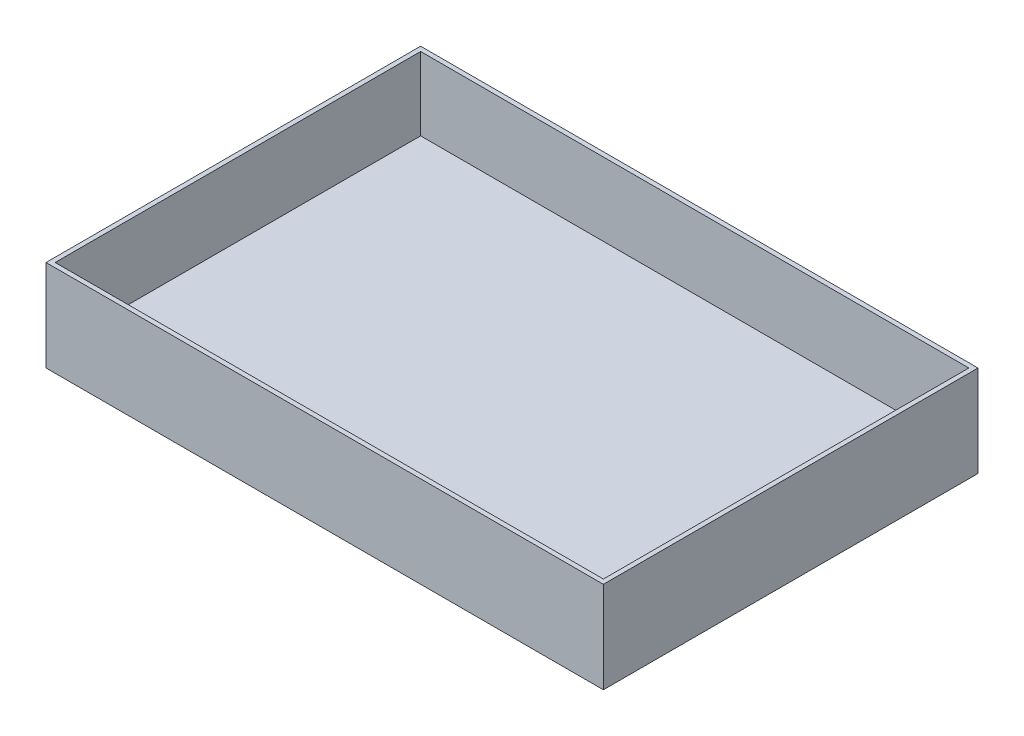
ISO-10303-21;
HEADER;
FILE_DESCRIPTION(('STEP AP214'),'2;1');
FILE_NAME('part.step','',(''),(''),'','','');
FILE_SCHEMA(('AUTOMOTIVE_DESIGN { 1 0 10303 214 1 1 1 1 }'));
ENDSEC;
DATA;
#1=APPLICATION_CONTEXT('core data for automotive mechanical design processes');
#2=APPLICATION_PROTOCOL_DEFINITION('international standard','automotive_design',2000,#1);
#3=PRODUCT_CONTEXT('',#1,'mechanical');
#4=PRODUCT('Part','Part','',(#3));
#5=PRODUCT_RELATED_PRODUCT_CATEGORY('part','',(#4));
#6=PRODUCT_DEFINITION_FORMATION('','',#4);
#7=PRODUCT_DEFINITION_CONTEXT('part definition',#1,'design');
#8=PRODUCT_DEFINITION('design','',#6,#7);
#9=PRODUCT_DEFINITION_SHAPE('','',#8);
#10=(LENGTH_UNIT() NAMED_UNIT(*) SI_UNIT(.MILLI.,.METRE.));
#11=(NAMED_UNIT(*) PLANE_ANGLE_UNIT() SI_UNIT($,.RADIAN.));
#12=(NAMED_UNIT(*) SI_UNIT($,.STERADIAN.) SOLID_ANGLE_UNIT());
#13=UNCERTAINTY_MEASURE_WITH_UNIT(LENGTH_MEASURE(1.E-05),#10,'distance_accuracy_value','');
#14=(GEOMETRIC_REPRESENTATION_CONTEXT(3) GLOBAL_UNCERTAINTY_ASSIGNED_CONTEXT((#13)) GLOBAL_UNIT_ASSIGNED_CONTEXT((#10,
#11,#12)) REPRESENTATION_CONTEXT('',''));
#15=CARTESIAN_POINT('',(0.,0.,0.));
#16=DIRECTION('',(0.,0.,1.));
#17=DIRECTION('',(1.,0.,0.));
#18=AXIS2_PLACEMENT_3D('',#15,#16,#17);
#19=CARTESIAN_POINT('',(-30.5,10.,-20.5));
#20=DIRECTION('',(1.,0.,0.));
#21=DIRECTION('',(0.,0.,-1.));
#22=AXIS2_PLACEMENT_3D('',#19,#20,#21);
#23=PLANE('',#22);
#24=DIRECTION('',(0.,0.,1.));
#25=VECTOR('',#24,1.);
#26=CARTESIAN_POINT('',(-30.5,0.,-20.5));
#27=LINE('',#26,#25);
#28=CARTESIAN_POINT('',(-30.5,0.,-20.5));
#29=VERTEX_POINT('',#28);
#30=CARTESIAN_POINT('',(-30.5,0.,20.5));
#31=VERTEX_POINT('',#30);
#32=EDGE_CURVE('E157',#29,#31,#27,.T.);
#33=ORIENTED_EDGE('',*,*,#32,.T.);
#34=DIRECTION('',(0.,-1.,0.));
#35=VECTOR('',#34,1.);
#36=CARTESIAN_POINT('',(-30.5,10.,20.5));
#37=LINE('',#36,#35);
#38=CARTESIAN_POINT('',(-30.5,10.,20.5));
#39=VERTEX_POINT('',#38);
#40=EDGE_CURVE('E11',#39,#31,#37,.T.);
#41=ORIENTED_EDGE('',*,*,#40,.F.);
#42=DIRECTION('',(0.,0.,1.));
#43=VECTOR('',#42,1.);
#44=CARTESIAN_POINT('',(-30.5,10.,-20.5));
#45=LINE('',#44,#43);
#46=CARTESIAN_POINT('',(-30.5,10.,-20.5));
#47=VERTEX_POINT('',#46);
#48=EDGE_CURVE('E163',#47,#39,#45,.T.);
#49=ORIENTED_EDGE('',*,*,#48,.F.);
#50=DIRECTION('',(0.,-1.,0.));
#51=VECTOR('',#50,1.);
#52=CARTESIAN_POINT('',(-30.5,10.,-20.5));
#53=LINE('',#52,#51);
#54=EDGE_CURVE('E63',#47,#29,#53,.T.);
#55=ORIENTED_EDGE('',*,*,#54,.T.);
#56=EDGE_LOOP('',(#33,#41,#49,#55));
#57=FACE_BOUND('',#56,.T.);
#58=ADVANCED_FACE('F39',(#57),#23,.F.);
#59=CARTESIAN_POINT('',(-30.5,10.,20.5));
#60=DIRECTION('',(0.,0.,-1.));
#61=DIRECTION('',(-1.,0.,0.));
#62=AXIS2_PLACEMENT_3D('',#59,#60,#61);
#63=PLANE('',#62);
#64=DIRECTION('',(1.,0.,0.));
#65=VECTOR('',#64,1.);
#66=CARTESIAN_POINT('',(-30.5,0.,20.5));
#67=LINE('',#66,#65);
#68=CARTESIAN_POINT('',(30.5,0.,20.5));
#69=VERTEX_POINT('',#68);
#70=EDGE_CURVE('E178',#31,#69,#67,.T.);
#71=ORIENTED_EDGE('',*,*,#70,.T.);
#72=DIRECTION('',(0.,-1.,0.));
#73=VECTOR('',#72,1.);
#74=CARTESIAN_POINT('',(30.5,10.,20.5));
#75=LINE('',#74,#73);
#76=CARTESIAN_POINT('',(30.5,10.,20.5));
#77=VERTEX_POINT('',#76);
#78=EDGE_CURVE('E47',#77,#69,#75,.T.);
#79=ORIENTED_EDGE('',*,*,#78,.F.);
#80=DIRECTION('',(1.,0.,0.));
#81=VECTOR('',#80,1.);
#82=CARTESIAN_POINT('',(-30.5,10.,20.5));
#83=LINE('',#82,#81);
#84=EDGE_CURVE('E89',#39,#77,#83,.T.);
#85=ORIENTED_EDGE('',*,*,#84,.F.);
#86=ORIENTED_EDGE('',*,*,#40,.T.);
#87=EDGE_LOOP('',(#71,#79,#85,#86));
#88=FACE_BOUND('',#87,.T.);
#89=ADVANCED_FACE('F198',(#88),#63,.F.);
#90=CARTESIAN_POINT('',(30.5,10.,-20.5));
#91=DIRECTION('',(1.,0.,0.));
#92=DIRECTION('',(0.,0.,-1.));
#93=AXIS2_PLACEMENT_3D('',#90,#91,#92);
#94=PLANE('',#93);
#95=DIRECTION('',(0.,0.,1.));
#96=VECTOR('',#95,1.);
#97=CARTESIAN_POINT('',(30.5,0.,-20.5));
#98=LINE('',#97,#96);
#99=CARTESIAN_POINT('',(30.5,0.,-20.5));
#100=VERTEX_POINT('',#99);
#101=EDGE_CURVE('E182',#100,#69,#98,.T.);
#102=ORIENTED_EDGE('',*,*,#101,.F.);
#103=DIRECTION('',(0.,-1.,0.));
#104=VECTOR('',#103,1.);
#105=CARTESIAN_POINT('',(30.5,10.,-20.5));
#106=LINE('',#105,#104);
#107=CARTESIAN_POINT('',(30.5,10.,-20.5));
#108=VERTEX_POINT('',#107);
#109=EDGE_CURVE('E191',#108,#100,#106,.T.);
#110=ORIENTED_EDGE('',*,*,#109,.F.);
#111=DIRECTION('',(0.,0.,1.));
#112=VECTOR('',#111,1.);
#113=CARTESIAN_POINT('',(30.5,10.,-20.5));
#114=LINE('',#113,#112);
#115=EDGE_CURVE('E169',#108,#77,#114,.T.);
#116=ORIENTED_EDGE('',*,*,#115,.T.);
#117=ORIENTED_EDGE('',*,*,#78,.T.);
#118=EDGE_LOOP('',(#102,#110,#116,#117));
#119=FACE_BOUND('',#118,.T.);
#120=ADVANCED_FACE('F196',(#119),#94,.T.);
#121=CARTESIAN_POINT('',(-30.5,10.,-20.5));
#122=DIRECTION('',(0.,0.,-1.));
#123=DIRECTION('',(-1.,0.,0.));
#124=AXIS2_PLACEMENT_3D('',#121,#122,#123);
#125=PLANE('',#124);
#126=DIRECTION('',(1.,0.,0.));
#127=VECTOR('',#126,1.);
#128=CARTESIAN_POINT('',(-30.5,0.,-20.5));
#129=LINE('',#128,#127);
#130=EDGE_CURVE('E166',#29,#100,#129,.T.);
#131=ORIENTED_EDGE('',*,*,#130,.F.);
#132=ORIENTED_EDGE('',*,*,#54,.F.);
#133=DIRECTION('',(1.,0.,0.));
#134=VECTOR('',#133,1.);
#135=CARTESIAN_POINT('',(-30.5,10.,-20.5));
#136=LINE('',#135,#134);
#137=EDGE_CURVE('E173',#47,#108,#136,.T.);
#138=ORIENTED_EDGE('',*,*,#137,.T.);
#139=ORIENTED_EDGE('',*,*,#109,.T.);
#140=EDGE_LOOP('',(#131,#132,#138,#139));
#141=FACE_BOUND('',#140,.T.);
#142=ADVANCED_FACE('F202',(#141),#125,.T.);
#143=CARTESIAN_POINT('',(0.,10.,0.));
#144=DIRECTION('',(0.,1.,0.));
#145=DIRECTION('',(0.,0.,1.));
#146=AXIS2_PLACEMENT_3D('',#143,#144,#145);
#147=PLANE('',#146);
#148=DIRECTION('',(0.,0.,-1.));
#149=VECTOR('',#148,1.);
#150=CARTESIAN_POINT('',(30.,10.,-20.));
#151=LINE('',#150,#149);
#152=CARTESIAN_POINT('',(30.,10.,20.));
#153=VERTEX_POINT('',#152);
#154=CARTESIAN_POINT('',(30.,10.,-20.));
#155=VERTEX_POINT('',#154);
#156=EDGE_CURVE('E54',#153,#155,#151,.T.);
#157=ORIENTED_EDGE('',*,*,#156,.F.);
#158=DIRECTION('',(1.,0.,0.));
#159=VECTOR('',#158,1.);
#160=CARTESIAN_POINT('',(-30.,10.,20.));
#161=LINE('',#160,#159);
#162=CARTESIAN_POINT('',(-30.,10.,20.));
#163=VERTEX_POINT('',#162);
#164=EDGE_CURVE('E135',#163,#153,#161,.T.);
#165=ORIENTED_EDGE('',*,*,#164,.F.);
#166=DIRECTION('',(0.,0.,1.));
#167=VECTOR('',#166,1.);
#168=CARTESIAN_POINT('',(-30.,10.,-20.));
#169=LINE('',#168,#167);
#170=CARTESIAN_POINT('',(-30.,10.,-20.));
#171=VERTEX_POINT('',#170);
#172=EDGE_CURVE('E139',#171,#163,#169,.T.);
#173=ORIENTED_EDGE('',*,*,#172,.F.);
#174=DIRECTION('',(-1.,0.,0.));
#175=VECTOR('',#174,1.);
#176=CARTESIAN_POINT('',(-30.,10.,-20.));
#177=LINE('',#176,#175);
#178=EDGE_CURVE('E148',#155,#171,#177,.T.);
#179=ORIENTED_EDGE('',*,*,#178,.F.);
#180=EDGE_LOOP('',(#157,#165,#173,#179));
#181=FACE_BOUND('',#180,.T.);
#182=ORIENTED_EDGE('',*,*,#48,.T.);
#183=ORIENTED_EDGE('',*,*,#84,.T.);
#184=ORIENTED_EDGE('',*,*,#115,.F.);
#185=ORIENTED_EDGE('',*,*,#137,.F.);
#186=EDGE_LOOP('',(#182,#183,#184,#185));
#187=FACE_BOUND('',#186,.T.);
#188=ADVANCED_FACE('F205',(#181,#187),#147,.T.);
#189=CARTESIAN_POINT('',(0.,0.,0.));
#190=DIRECTION('',(0.,1.,0.));
#191=DIRECTION('',(0.,0.,1.));
#192=AXIS2_PLACEMENT_3D('',#189,#190,#191);
#193=PLANE('',#192);
#194=ORIENTED_EDGE('',*,*,#32,.F.);
#195=ORIENTED_EDGE('',*,*,#130,.T.);
#196=ORIENTED_EDGE('',*,*,#101,.T.);
#197=ORIENTED_EDGE('',*,*,#70,.F.);
#198=EDGE_LOOP('',(#194,#195,#196,#197));
#199=FACE_BOUND('',#198,.T.);
#200=ADVANCED_FACE('F201',(#199),#193,.F.);
#201=CARTESIAN_POINT('',(30.,2.,-20.));
#202=DIRECTION('',(1.,0.,0.));
#203=DIRECTION('',(0.,0.,-1.));
#204=AXIS2_PLACEMENT_3D('',#201,#202,#203);
#205=PLANE('',#204);
#206=ORIENTED_EDGE('',*,*,#156,.T.);
#207=DIRECTION('',(0.,1.,0.));
#208=VECTOR('',#207,1.);
#209=CARTESIAN_POINT('',(30.,2.,-20.));
#210=LINE('',#209,#208);
#211=CARTESIAN_POINT('',(30.,2.,-20.));
#212=VERTEX_POINT('',#211);
#213=EDGE_CURVE('E110',#212,#155,#210,.T.);
#214=ORIENTED_EDGE('',*,*,#213,.F.);
#215=DIRECTION('',(0.,0.,-1.));
#216=VECTOR('',#215,1.);
#217=CARTESIAN_POINT('',(30.,2.,-20.));
#218=LINE('',#217,#216);
#219=CARTESIAN_POINT('',(30.,2.,20.));
#220=VERTEX_POINT('',#219);
#221=EDGE_CURVE('E114',#220,#212,#218,.T.);
#222=ORIENTED_EDGE('',*,*,#221,.F.);
#223=DIRECTION('',(0.,1.,0.));
#224=VECTOR('',#223,1.);
#225=CARTESIAN_POINT('',(30.,2.,20.));
#226=LINE('',#225,#224);
#227=EDGE_CURVE('E154',#220,#153,#226,.T.);
#228=ORIENTED_EDGE('',*,*,#227,.T.);
#229=EDGE_LOOP('',(#206,#214,#222,#228));
#230=FACE_BOUND('',#229,.T.);
#231=ADVANCED_FACE('F112',(#230),#205,.F.);
#232=CARTESIAN_POINT('',(-30.,2.,20.));
#233=DIRECTION('',(0.,0.,1.));
#234=DIRECTION('',(1.,0.,0.));
#235=AXIS2_PLACEMENT_3D('',#232,#233,#234);
#236=PLANE('',#235);
#237=ORIENTED_EDGE('',*,*,#164,.T.);
#238=ORIENTED_EDGE('',*,*,#227,.F.);
#239=DIRECTION('',(1.,0.,0.));
#240=VECTOR('',#239,1.);
#241=CARTESIAN_POINT('',(-30.,2.,20.));
#242=LINE('',#241,#240);
#243=CARTESIAN_POINT('',(-30.,2.,20.));
#244=VERTEX_POINT('',#243);
#245=EDGE_CURVE('E121',#244,#220,#242,.T.);
#246=ORIENTED_EDGE('',*,*,#245,.F.);
#247=DIRECTION('',(0.,1.,0.));
#248=VECTOR('',#247,1.);
#249=CARTESIAN_POINT('',(-30.,2.,20.));
#250=LINE('',#249,#248);
#251=EDGE_CURVE('E158',#244,#163,#250,.T.);
#252=ORIENTED_EDGE('',*,*,#251,.T.);
#253=EDGE_LOOP('',(#237,#238,#246,#252));
#254=FACE_BOUND('',#253,.T.);
#255=ADVANCED_FACE('F224',(#254),#236,.F.);
#256=CARTESIAN_POINT('',(-30.,2.,-20.));
#257=DIRECTION('',(-1.,0.,0.));
#258=DIRECTION('',(0.,0.,1.));
#259=AXIS2_PLACEMENT_3D('',#256,#257,#258);
#260=PLANE('',#259);
#261=ORIENTED_EDGE('',*,*,#172,.T.);
#262=ORIENTED_EDGE('',*,*,#251,.F.);
#263=DIRECTION('',(0.,0.,1.));
#264=VECTOR('',#263,1.);
#265=CARTESIAN_POINT('',(-30.,2.,-20.));
#266=LINE('',#265,#264);
#267=CARTESIAN_POINT('',(-30.,2.,-20.));
#268=VERTEX_POINT('',#267);
#269=EDGE_CURVE('E130',#268,#244,#266,.T.);
#270=ORIENTED_EDGE('',*,*,#269,.F.);
#271=DIRECTION('',(0.,1.,0.));
#272=VECTOR('',#271,1.);
#273=CARTESIAN_POINT('',(-30.,2.,-20.));
#274=LINE('',#273,#272);
#275=EDGE_CURVE('E120',#268,#171,#274,.T.);
#276=ORIENTED_EDGE('',*,*,#275,.T.);
#277=EDGE_LOOP('',(#261,#262,#270,#276));
#278=FACE_BOUND('',#277,.T.);
#279=ADVANCED_FACE('F227',(#278),#260,.F.);
#280=CARTESIAN_POINT('',(-30.,2.,-20.));
#281=DIRECTION('',(0.,0.,-1.));
#282=DIRECTION('',(-1.,0.,0.));
#283=AXIS2_PLACEMENT_3D('',#280,#281,#282);
#284=PLANE('',#283);
#285=ORIENTED_EDGE('',*,*,#178,.T.);
#286=ORIENTED_EDGE('',*,*,#275,.F.);
#287=DIRECTION('',(-1.,0.,0.));
#288=VECTOR('',#287,1.);
#289=CARTESIAN_POINT('',(-30.,2.,-20.));
#290=LINE('',#289,#288);
#291=EDGE_CURVE('E124',#212,#268,#290,.T.);
#292=ORIENTED_EDGE('',*,*,#291,.F.);
#293=ORIENTED_EDGE('',*,*,#213,.T.);
#294=EDGE_LOOP('',(#285,#286,#292,#293));
#295=FACE_BOUND('',#294,.T.);
#296=ADVANCED_FACE('F125',(#295),#284,.F.);
#297=CARTESIAN_POINT('',(0.,2.,0.));
#298=DIRECTION('',(0.,1.,0.));
#299=DIRECTION('',(0.,0.,1.));
#300=AXIS2_PLACEMENT_3D('',#297,#298,#299);
#301=PLANE('',#300);
#302=ORIENTED_EDGE('',*,*,#221,.T.);
#303=ORIENTED_EDGE('',*,*,#291,.T.);
#304=ORIENTED_EDGE('',*,*,#269,.T.);
#305=ORIENTED_EDGE('',*,*,#245,.T.);
#306=EDGE_LOOP('',(#302,#303,#304,#305));
#307=FACE_BOUND('',#306,.T.);
#308=ADVANCED_FACE('F132',(#307),#301,.T.);
#309=CLOSED_SHELL('',(#58,#89,#120,#142,#188,#200,#231,#255,#279,#296,#308));
#310=MANIFOLD_SOLID_BREP('B2',#309);
#311=ADVANCED_BREP_SHAPE_REPRESENTATION('',(#18,#310),#14);
#312=SHAPE_DEFINITION_REPRESENTATION(#9,#311);
ENDSEC;
END-ISO-10303-21;
